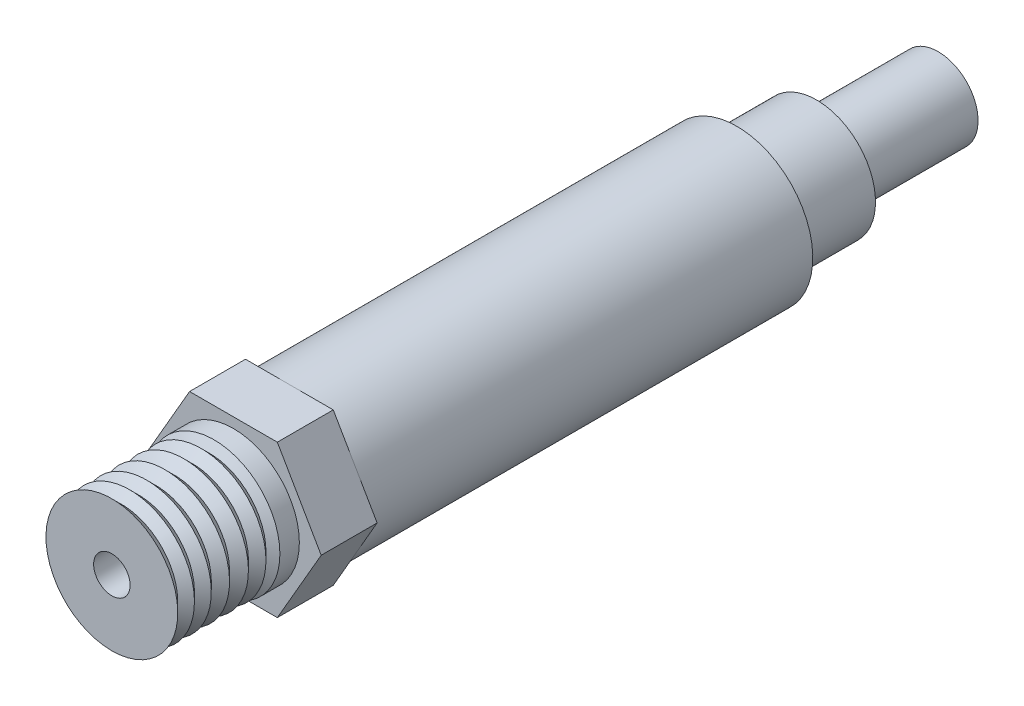
ISO-10303-21;
HEADER;
FILE_DESCRIPTION(('STEP AP214'),'2;1');
FILE_NAME('part.step','',(''),(''),'','','');
FILE_SCHEMA(('AUTOMOTIVE_DESIGN { 1 0 10303 214 1 1 1 1 }'));
ENDSEC;
DATA;
#1=APPLICATION_CONTEXT('core data for automotive mechanical design processes');
#2=APPLICATION_PROTOCOL_DEFINITION('international standard','automotive_design',2000,#1);
#3=PRODUCT_CONTEXT('',#1,'mechanical');
#4=PRODUCT('Part','Part','',(#3));
#5=PRODUCT_RELATED_PRODUCT_CATEGORY('part','',(#4));
#6=PRODUCT_DEFINITION_FORMATION('','',#4);
#7=PRODUCT_DEFINITION_CONTEXT('part definition',#1,'design');
#8=PRODUCT_DEFINITION('design','',#6,#7);
#9=PRODUCT_DEFINITION_SHAPE('','',#8);
#10=(LENGTH_UNIT() NAMED_UNIT(*) SI_UNIT(.MILLI.,.METRE.));
#11=(NAMED_UNIT(*) PLANE_ANGLE_UNIT() SI_UNIT($,.RADIAN.));
#12=(NAMED_UNIT(*) SI_UNIT($,.STERADIAN.) SOLID_ANGLE_UNIT());
#13=UNCERTAINTY_MEASURE_WITH_UNIT(LENGTH_MEASURE(1.E-05),#10,'distance_accuracy_value','');
#14=(GEOMETRIC_REPRESENTATION_CONTEXT(3) GLOBAL_UNCERTAINTY_ASSIGNED_CONTEXT((#13)) GLOBAL_UNIT_ASSIGNED_CONTEXT((#10,
#11,#12)) REPRESENTATION_CONTEXT('',''));
#15=CARTESIAN_POINT('',(0.,0.,0.));
#16=DIRECTION('',(0.,0.,1.));
#17=DIRECTION('',(1.,0.,0.));
#18=AXIS2_PLACEMENT_3D('',#15,#16,#17);
#19=CARTESIAN_POINT('',(0.,0.,-62.944375));
#20=DIRECTION('',(0.,0.,-1.));
#21=DIRECTION('',(-1.,0.,0.));
#22=AXIS2_PLACEMENT_3D('',#19,#20,#21);
#23=PLANE('',#22);
#24=CARTESIAN_POINT('',(0.,0.,-62.944375));
#25=DIRECTION('',(0.,0.,-1.));
#26=DIRECTION('',(-1.,0.,0.));
#27=AXIS2_PLACEMENT_3D('',#24,#25,#26);
#28=CIRCLE('',#27,6.1515625);
#29=CARTESIAN_POINT('',(-6.1515625,0.,-62.944375));
#30=VERTEX_POINT('',#29);
#31=EDGE_CURVE('E127',#30,#30,#28,.T.);
#32=ORIENTED_EDGE('',*,*,#31,.T.);
#33=EDGE_LOOP('',(#32));
#34=FACE_BOUND('',#33,.T.);
#35=CARTESIAN_POINT('',(0.,0.,-62.944375));
#36=DIRECTION('',(0.,0.,-1.));
#37=DIRECTION('',(-1.,0.,0.));
#38=AXIS2_PLACEMENT_3D('',#35,#36,#37);
#39=CIRCLE('',#38,4.1671875);
#40=CARTESIAN_POINT('',(-4.1671875,0.,-62.944375));
#41=VERTEX_POINT('',#40);
#42=EDGE_CURVE('E594',#41,#41,#39,.T.);
#43=ORIENTED_EDGE('',*,*,#42,.F.);
#44=EDGE_LOOP('',(#43));
#45=FACE_BOUND('',#44,.T.);
#46=ADVANCED_FACE('F32',(#34,#45),#23,.T.);
#47=CARTESIAN_POINT('',(0.,0.,-54.61));
#48=DIRECTION('',(0.,0.,-1.));
#49=DIRECTION('',(-1.,0.,0.));
#50=AXIS2_PLACEMENT_3D('',#47,#48,#49);
#51=PLANE('',#50);
#52=CARTESIAN_POINT('',(0.,0.,-54.61));
#53=DIRECTION('',(0.,0.,-1.));
#54=DIRECTION('',(-1.,0.,0.));
#55=AXIS2_PLACEMENT_3D('',#52,#53,#54);
#56=CIRCLE('',#55,7.9375);
#57=CARTESIAN_POINT('',(-7.9375,0.,-54.61));
#58=VERTEX_POINT('',#57);
#59=EDGE_CURVE('E126',#58,#58,#56,.T.);
#60=ORIENTED_EDGE('',*,*,#59,.T.);
#61=EDGE_LOOP('',(#60));
#62=FACE_BOUND('',#61,.T.);
#63=CARTESIAN_POINT('',(0.,0.,-54.61));
#64=DIRECTION('',(0.,0.,-1.));
#65=DIRECTION('',(-1.,0.,0.));
#66=AXIS2_PLACEMENT_3D('',#63,#64,#65);
#67=CIRCLE('',#66,6.1515625);
#68=CARTESIAN_POINT('',(-6.1515625,0.,-54.61));
#69=VERTEX_POINT('',#68);
#70=EDGE_CURVE('E593',#69,#69,#67,.T.);
#71=ORIENTED_EDGE('',*,*,#70,.F.);
#72=EDGE_LOOP('',(#71));
#73=FACE_BOUND('',#72,.T.);
#74=ADVANCED_FACE('F242',(#62,#73),#51,.T.);
#75=CARTESIAN_POINT('',(9.16543552338531,0.,-7.874));
#76=DIRECTION('',(0.,0.,-1.));
#77=DIRECTION('',(-1.,0.,0.));
#78=AXIS2_PLACEMENT_3D('',#75,#76,#77);
#79=PLANE('',#78);
#80=CARTESIAN_POINT('',(0.,0.,-7.874));
#81=DIRECTION('',(0.,0.,-1.));
#82=DIRECTION('',(-1.,0.,0.));
#83=AXIS2_PLACEMENT_3D('',#80,#81,#82);
#84=CIRCLE('',#83,7.9375);
#85=CARTESIAN_POINT('',(-6.87407664253898,3.96875,-7.874));
#86=VERTEX_POINT('',#85);
#87=CARTESIAN_POINT('',(0.,7.9375,-7.874));
#88=VERTEX_POINT('',#87);
#89=EDGE_CURVE('E43',#86,#88,#84,.T.);
#90=ORIENTED_EDGE('',*,*,#89,.F.);
#91=DIRECTION('',(0.5,0.866025403784439,0.));
#92=VECTOR('',#91,1.);
#93=CARTESIAN_POINT('',(-4.58271776169266,7.9375,-7.874));
#94=LINE('',#93,#92);
#95=CARTESIAN_POINT('',(-4.58271776169266,7.9375,-7.874));
#96=VERTEX_POINT('',#95);
#97=EDGE_CURVE('E111',#86,#96,#94,.T.);
#98=ORIENTED_EDGE('',*,*,#97,.T.);
#99=DIRECTION('',(1.,0.,0.));
#100=VECTOR('',#99,1.);
#101=CARTESIAN_POINT('',(4.58271776169265,7.9375,-7.874));
#102=LINE('',#101,#100);
#103=EDGE_CURVE('E124',#96,#88,#102,.T.);
#104=ORIENTED_EDGE('',*,*,#103,.T.);
#105=EDGE_LOOP('',(#90,#98,#104));
#106=FACE_BOUND('',#105,.T.);
#107=ADVANCED_FACE('F123',(#106),#79,.T.);
#108=CARTESIAN_POINT('',(6.87407664253898,3.96875,-7.874));
#109=VERTEX_POINT('',#108);
#110=EDGE_CURVE('E11',#88,#109,#84,.T.);
#111=ORIENTED_EDGE('',*,*,#110,.F.);
#112=CARTESIAN_POINT('',(4.58271776169265,7.9375,-7.874));
#113=VERTEX_POINT('',#112);
#114=EDGE_CURVE('E110',#88,#113,#102,.T.);
#115=ORIENTED_EDGE('',*,*,#114,.T.);
#116=DIRECTION('',(0.5,-0.866025403784438,0.));
#117=VECTOR('',#116,1.);
#118=CARTESIAN_POINT('',(9.16543552338531,0.,-7.874));
#119=LINE('',#118,#117);
#120=EDGE_CURVE('E154',#113,#109,#119,.T.);
#121=ORIENTED_EDGE('',*,*,#120,.T.);
#122=EDGE_LOOP('',(#111,#115,#121));
#123=FACE_BOUND('',#122,.T.);
#124=ADVANCED_FACE('F472',(#123),#79,.T.);
#125=CARTESIAN_POINT('',(6.87407664253898,-3.96875,-7.874));
#126=VERTEX_POINT('',#125);
#127=EDGE_CURVE('E41',#109,#126,#84,.T.);
#128=ORIENTED_EDGE('',*,*,#127,.F.);
#129=CARTESIAN_POINT('',(9.16543552338531,0.,-7.874));
#130=VERTEX_POINT('',#129);
#131=EDGE_CURVE('E153',#109,#130,#119,.T.);
#132=ORIENTED_EDGE('',*,*,#131,.T.);
#133=DIRECTION('',(-0.5,-0.866025403784439,0.));
#134=VECTOR('',#133,1.);
#135=CARTESIAN_POINT('',(4.58271776169265,-7.9375,-7.874));
#136=LINE('',#135,#134);
#137=EDGE_CURVE('E157',#130,#126,#136,.T.);
#138=ORIENTED_EDGE('',*,*,#137,.T.);
#139=EDGE_LOOP('',(#128,#132,#138));
#140=FACE_BOUND('',#139,.T.);
#141=ADVANCED_FACE('F479',(#140),#79,.T.);
#142=CARTESIAN_POINT('',(0.,-7.9375,-7.874));
#143=VERTEX_POINT('',#142);
#144=EDGE_CURVE('E132',#126,#143,#84,.T.);
#145=ORIENTED_EDGE('',*,*,#144,.F.);
#146=CARTESIAN_POINT('',(4.58271776169265,-7.9375,-7.874));
#147=VERTEX_POINT('',#146);
#148=EDGE_CURVE('E156',#126,#147,#136,.T.);
#149=ORIENTED_EDGE('',*,*,#148,.T.);
#150=DIRECTION('',(-1.,0.,0.));
#151=VECTOR('',#150,1.);
#152=CARTESIAN_POINT('',(4.58271776169265,-7.9375,-7.874));
#153=LINE('',#152,#151);
#154=EDGE_CURVE('E161',#147,#143,#153,.T.);
#155=ORIENTED_EDGE('',*,*,#154,.T.);
#156=EDGE_LOOP('',(#145,#149,#155));
#157=FACE_BOUND('',#156,.T.);
#158=ADVANCED_FACE('F486',(#157),#79,.T.);
#159=CARTESIAN_POINT('',(-6.87407664253898,-3.96875,-7.874));
#160=VERTEX_POINT('',#159);
#161=EDGE_CURVE('E131',#143,#160,#84,.T.);
#162=ORIENTED_EDGE('',*,*,#161,.F.);
#163=CARTESIAN_POINT('',(-4.58271776169265,-7.9375,-7.874));
#164=VERTEX_POINT('',#163);
#165=EDGE_CURVE('E160',#143,#164,#153,.T.);
#166=ORIENTED_EDGE('',*,*,#165,.T.);
#167=DIRECTION('',(-0.5,0.866025403784439,0.));
#168=VECTOR('',#167,1.);
#169=CARTESIAN_POINT('',(-9.16543552338531,0.,-7.874));
#170=LINE('',#169,#168);
#171=EDGE_CURVE('E121',#164,#160,#170,.T.);
#172=ORIENTED_EDGE('',*,*,#171,.T.);
#173=EDGE_LOOP('',(#162,#166,#172));
#174=FACE_BOUND('',#173,.T.);
#175=ADVANCED_FACE('F270',(#174),#79,.T.);
#176=CARTESIAN_POINT('',(0.,0.,10.668));
#177=DIRECTION('',(0.,0.,1.));
#178=DIRECTION('',(1.,0.,0.));
#179=AXIS2_PLACEMENT_3D('',#176,#177,#178);
#180=PLANE('',#179);
#181=CARTESIAN_POINT('',(0.,0.,10.668));
#182=DIRECTION('',(0.,0.,1.));
#183=DIRECTION('',(1.,0.,0.));
#184=AXIS2_PLACEMENT_3D('',#181,#182,#183);
#185=CIRCLE('',#184,1.905);
#186=CARTESIAN_POINT('',(1.905,0.,10.668));
#187=VERTEX_POINT('',#186);
#188=EDGE_CURVE('E185',#187,#187,#185,.T.);
#189=ORIENTED_EDGE('',*,*,#188,.F.);
#190=EDGE_LOOP('',(#189));
#191=FACE_BOUND('',#190,.T.);
#192=CARTESIAN_POINT('',(0.,0.,10.668));
#193=DIRECTION('',(0.,0.,1.));
#194=DIRECTION('',(0.,-1.,0.));
#195=AXIS2_PLACEMENT_3D('',#192,#193,#194);
#196=CIRCLE('',#195,6.88339999999998);
#197=CARTESIAN_POINT('',(0.,-6.88339999999998,10.668));
#198=VERTEX_POINT('',#197);
#199=EDGE_CURVE('E36',#198,#198,#196,.T.);
#200=ORIENTED_EDGE('',*,*,#199,.T.);
#201=EDGE_LOOP('',(#200));
#202=FACE_BOUND('',#201,.T.);
#203=ADVANCED_FACE('F34',(#191,#202),#180,.T.);
#204=CARTESIAN_POINT('',(0.,0.,10.668));
#205=DIRECTION('',(0.,0.,1.));
#206=DIRECTION('',(0.,-1.,0.));
#207=AXIS2_PLACEMENT_3D('',#204,#205,#206);
#208=CONICAL_SURFACE('',#207,6.88339999999998,0.785398163397433);
#209=CARTESIAN_POINT('',(0.,0.,9.67293695090437));
#210=DIRECTION('',(0.,0.,1.));
#211=DIRECTION('',(0.,-1.,0.));
#212=AXIS2_PLACEMENT_3D('',#209,#210,#211);
#213=CIRCLE('',#212,5.88833695090438);
#214=CARTESIAN_POINT('',(0.,-5.88833695090438,9.67293695090437));
#215=VERTEX_POINT('',#214);
#216=EDGE_CURVE('E134',#215,#215,#213,.T.);
#217=ORIENTED_EDGE('',*,*,#216,.T.);
#218=EDGE_LOOP('',(#217));
#219=FACE_BOUND('',#218,.T.);
#220=ORIENTED_EDGE('',*,*,#199,.F.);
#221=EDGE_LOOP('',(#220));
#222=FACE_BOUND('',#221,.T.);
#223=ADVANCED_FACE('F226',(#219,#222),#208,.T.);
#224=CARTESIAN_POINT('',(0.,0.,9.67293695090437));
#225=DIRECTION('',(0.,0.,-1.));
#226=DIRECTION('',(0.,1.,0.));
#227=AXIS2_PLACEMENT_3D('',#224,#225,#226);
#228=CONICAL_SURFACE('',#227,5.88833695090438,0.785398163397464);
#229=CARTESIAN_POINT('',(0.,0.,8.80237984496124));
#230=DIRECTION('',(0.,0.,1.));
#231=DIRECTION('',(0.,-1.,0.));
#232=AXIS2_PLACEMENT_3D('',#229,#230,#231);
#233=CIRCLE('',#232,6.75889405684754);
#234=CARTESIAN_POINT('',(0.,-6.75889405684754,8.80237984496124));
#235=VERTEX_POINT('',#234);
#236=EDGE_CURVE('E221',#235,#235,#233,.T.);
#237=ORIENTED_EDGE('',*,*,#236,.T.);
#238=EDGE_LOOP('',(#237));
#239=FACE_BOUND('',#238,.T.);
#240=ORIENTED_EDGE('',*,*,#216,.F.);
#241=EDGE_LOOP('',(#240));
#242=FACE_BOUND('',#241,.T.);
#243=ADVANCED_FACE('F229',(#239,#242),#228,.T.);
#244=CARTESIAN_POINT('',(0.,0.,8.80237984496124));
#245=DIRECTION('',(0.,0.,1.));
#246=DIRECTION('',(0.,-1.,0.));
#247=AXIS2_PLACEMENT_3D('',#244,#245,#246);
#248=CONICAL_SURFACE('',#247,6.75889405684754,0.785398163397432);
#249=CARTESIAN_POINT('',(0.,0.,7.92194496124028));
#250=DIRECTION('',(0.,0.,1.));
#251=DIRECTION('',(0.,-1.,0.));
#252=AXIS2_PLACEMENT_3D('',#249,#250,#251);
#253=CIRCLE('',#252,5.87845917312661);
#254=CARTESIAN_POINT('',(0.,-5.87845917312661,7.92194496124028));
#255=VERTEX_POINT('',#254);
#256=EDGE_CURVE('E218',#255,#255,#253,.T.);
#257=ORIENTED_EDGE('',*,*,#256,.T.);
#258=EDGE_LOOP('',(#257));
#259=FACE_BOUND('',#258,.T.);
#260=ORIENTED_EDGE('',*,*,#236,.F.);
#261=EDGE_LOOP('',(#260));
#262=FACE_BOUND('',#261,.T.);
#263=ADVANCED_FACE('F231',(#259,#262),#248,.T.);
#264=CARTESIAN_POINT('',(0.,0.,7.92194496124028));
#265=DIRECTION('',(0.,0.,-1.));
#266=DIRECTION('',(0.,1.,0.));
#267=AXIS2_PLACEMENT_3D('',#264,#265,#266);
#268=CONICAL_SURFACE('',#267,5.87845917312661,0.785398163397464);
#269=CARTESIAN_POINT('',(0.,0.,7.04151007751938));
#270=DIRECTION('',(0.,0.,1.));
#271=DIRECTION('',(0.,-1.,0.));
#272=AXIS2_PLACEMENT_3D('',#269,#270,#271);
#273=CIRCLE('',#272,6.75889405684754);
#274=CARTESIAN_POINT('',(0.,-6.75889405684754,7.04151007751938));
#275=VERTEX_POINT('',#274);
#276=EDGE_CURVE('E215',#275,#275,#273,.T.);
#277=ORIENTED_EDGE('',*,*,#276,.T.);
#278=EDGE_LOOP('',(#277));
#279=FACE_BOUND('',#278,.T.);
#280=ORIENTED_EDGE('',*,*,#256,.F.);
#281=EDGE_LOOP('',(#280));
#282=FACE_BOUND('',#281,.T.);
#283=ADVANCED_FACE('F238',(#279,#282),#268,.T.);
#284=CARTESIAN_POINT('',(0.,0.,7.04151007751938));
#285=DIRECTION('',(0.,0.,1.));
#286=DIRECTION('',(0.,-1.,0.));
#287=AXIS2_PLACEMENT_3D('',#284,#285,#286);
#288=CONICAL_SURFACE('',#287,6.75889405684754,0.785398163397433);
#289=CARTESIAN_POINT('',(0.,0.,6.08992894056845));
#290=DIRECTION('',(0.,0.,1.));
#291=DIRECTION('',(0.,-1.,0.));
#292=AXIS2_PLACEMENT_3D('',#289,#290,#291);
#293=CIRCLE('',#292,5.80731291989664);
#294=CARTESIAN_POINT('',(0.,-5.80731291989664,6.08992894056845));
#295=VERTEX_POINT('',#294);
#296=EDGE_CURVE('E212',#295,#295,#293,.T.);
#297=ORIENTED_EDGE('',*,*,#296,.T.);
#298=EDGE_LOOP('',(#297));
#299=FACE_BOUND('',#298,.T.);
#300=ORIENTED_EDGE('',*,*,#276,.F.);
#301=EDGE_LOOP('',(#300));
#302=FACE_BOUND('',#301,.T.);
#303=ADVANCED_FACE('F331',(#299,#302),#288,.T.);
#304=CARTESIAN_POINT('',(0.,0.,6.08992894056845));
#305=DIRECTION('',(0.,0.,-1.));
#306=DIRECTION('',(0.,1.,0.));
#307=AXIS2_PLACEMENT_3D('',#304,#305,#306);
#308=CONICAL_SURFACE('',#307,5.80731291989664,0.785398163397464);
#309=CARTESIAN_POINT('',(0.,0.,5.13834780361757));
#310=DIRECTION('',(0.,0.,1.));
#311=DIRECTION('',(0.,-1.,0.));
#312=AXIS2_PLACEMENT_3D('',#309,#310,#311);
#313=CIRCLE('',#312,6.75889405684754);
#314=CARTESIAN_POINT('',(0.,-6.75889405684754,5.13834780361757));
#315=VERTEX_POINT('',#314);
#316=EDGE_CURVE('E209',#315,#315,#313,.T.);
#317=ORIENTED_EDGE('',*,*,#316,.T.);
#318=EDGE_LOOP('',(#317));
#319=FACE_BOUND('',#318,.T.);
#320=ORIENTED_EDGE('',*,*,#296,.F.);
#321=EDGE_LOOP('',(#320));
#322=FACE_BOUND('',#321,.T.);
#323=ADVANCED_FACE('F327',(#319,#322),#308,.T.);
#324=CARTESIAN_POINT('',(0.,0.,5.13834780361757));
#325=DIRECTION('',(0.,0.,1.));
#326=DIRECTION('',(0.,-1.,0.));
#327=AXIS2_PLACEMENT_3D('',#324,#325,#326);
#328=CONICAL_SURFACE('',#327,6.75889405684754,0.785398163397432);
#329=CARTESIAN_POINT('',(0.,0.,4.15119354005165));
#330=DIRECTION('',(0.,0.,1.));
#331=DIRECTION('',(0.,-1.,0.));
#332=AXIS2_PLACEMENT_3D('',#329,#330,#331);
#333=CIRCLE('',#332,5.77173979328165);
#334=CARTESIAN_POINT('',(0.,-5.77173979328165,4.15119354005165));
#335=VERTEX_POINT('',#334);
#336=EDGE_CURVE('E206',#335,#335,#333,.T.);
#337=ORIENTED_EDGE('',*,*,#336,.T.);
#338=EDGE_LOOP('',(#337));
#339=FACE_BOUND('',#338,.T.);
#340=ORIENTED_EDGE('',*,*,#316,.F.);
#341=EDGE_LOOP('',(#340));
#342=FACE_BOUND('',#341,.T.);
#343=ADVANCED_FACE('F323',(#339,#342),#328,.T.);
#344=CARTESIAN_POINT('',(0.,0.,4.15119354005165));
#345=DIRECTION('',(0.,0.,-1.));
#346=DIRECTION('',(0.,1.,0.));
#347=AXIS2_PLACEMENT_3D('',#344,#345,#346);
#348=CONICAL_SURFACE('',#347,5.77173979328165,0.785398163397465);
#349=CARTESIAN_POINT('',(0.,0.,3.16403927648579));
#350=DIRECTION('',(0.,0.,1.));
#351=DIRECTION('',(0.,-1.,0.));
#352=AXIS2_PLACEMENT_3D('',#349,#350,#351);
#353=CIRCLE('',#352,6.75889405684754);
#354=CARTESIAN_POINT('',(0.,-6.75889405684754,3.16403927648579));
#355=VERTEX_POINT('',#354);
#356=EDGE_CURVE('E203',#355,#355,#353,.T.);
#357=ORIENTED_EDGE('',*,*,#356,.T.);
#358=EDGE_LOOP('',(#357));
#359=FACE_BOUND('',#358,.T.);
#360=ORIENTED_EDGE('',*,*,#336,.F.);
#361=EDGE_LOOP('',(#360));
#362=FACE_BOUND('',#361,.T.);
#363=ADVANCED_FACE('F319',(#359,#362),#348,.T.);
#364=CARTESIAN_POINT('',(0.,0.,3.16403927648579));
#365=DIRECTION('',(0.,0.,1.));
#366=DIRECTION('',(0.,-1.,0.));
#367=AXIS2_PLACEMENT_3D('',#364,#365,#366);
#368=CONICAL_SURFACE('',#367,6.75889405684754,0.785398163397447);
#369=CARTESIAN_POINT('',(0.,0.,2.24803126614987));
#370=DIRECTION('',(0.,0.,1.));
#371=DIRECTION('',(0.,-1.,0.));
#372=AXIS2_PLACEMENT_3D('',#369,#370,#371);
#373=CIRCLE('',#372,5.84288604651162);
#374=CARTESIAN_POINT('',(0.,-5.84288604651162,2.24803126614987));
#375=VERTEX_POINT('',#374);
#376=EDGE_CURVE('E200',#375,#375,#373,.T.);
#377=ORIENTED_EDGE('',*,*,#376,.T.);
#378=EDGE_LOOP('',(#377));
#379=FACE_BOUND('',#378,.T.);
#380=ORIENTED_EDGE('',*,*,#356,.F.);
#381=EDGE_LOOP('',(#380));
#382=FACE_BOUND('',#381,.T.);
#383=ADVANCED_FACE('F315',(#379,#382),#368,.T.);
#384=CARTESIAN_POINT('',(0.,0.,2.24803126614987));
#385=DIRECTION('',(0.,0.,-1.));
#386=DIRECTION('',(0.,1.,0.));
#387=AXIS2_PLACEMENT_3D('',#384,#385,#386);
#388=CONICAL_SURFACE('',#387,5.84288604651162,0.78539816339745);
#389=CARTESIAN_POINT('',(0.,0.,1.33202325581396));
#390=DIRECTION('',(0.,0.,1.));
#391=DIRECTION('',(0.,-1.,0.));
#392=AXIS2_PLACEMENT_3D('',#389,#390,#391);
#393=CIRCLE('',#392,6.75889405684754);
#394=CARTESIAN_POINT('',(0.,-6.75889405684754,1.33202325581396));
#395=VERTEX_POINT('',#394);
#396=EDGE_CURVE('E197',#395,#395,#393,.T.);
#397=ORIENTED_EDGE('',*,*,#396,.T.);
#398=EDGE_LOOP('',(#397));
#399=FACE_BOUND('',#398,.T.);
#400=ORIENTED_EDGE('',*,*,#376,.F.);
#401=EDGE_LOOP('',(#400));
#402=FACE_BOUND('',#401,.T.);
#403=ADVANCED_FACE('F311',(#399,#402),#388,.T.);
#404=CARTESIAN_POINT('',(0.,0.,1.33202325581396));
#405=DIRECTION('',(0.,0.,1.));
#406=DIRECTION('',(0.,-1.,0.));
#407=AXIS2_PLACEMENT_3D('',#404,#405,#406);
#408=CONICAL_SURFACE('',#407,6.75889405684754,0.785398163397447);
#409=CARTESIAN_POINT('',(0.,0.,0.514702761949875));
#410=DIRECTION('',(0.,0.,1.));
#411=DIRECTION('',(0.,-1.,0.));
#412=AXIS2_PLACEMENT_3D('',#409,#410,#411);
#413=CIRCLE('',#412,5.94157356298346);
#414=CARTESIAN_POINT('',(0.,-5.94157356298346,0.514702761949876));
#415=VERTEX_POINT('',#414);
#416=EDGE_CURVE('E194',#415,#415,#413,.T.);
#417=ORIENTED_EDGE('',*,*,#416,.T.);
#418=EDGE_LOOP('',(#417));
#419=FACE_BOUND('',#418,.T.);
#420=ORIENTED_EDGE('',*,*,#396,.F.);
#421=EDGE_LOOP('',(#420));
#422=FACE_BOUND('',#421,.T.);
#423=ADVANCED_FACE('F307',(#419,#422),#408,.T.);
#424=CARTESIAN_POINT('',(0.,0.,0.514702761949875));
#425=DIRECTION('',(0.,0.,-1.));
#426=DIRECTION('',(0.,1.,0.));
#427=AXIS2_PLACEMENT_3D('',#424,#425,#426);
#428=CONICAL_SURFACE('',#427,5.94157356298346,1.07064863018592);
#429=CARTESIAN_POINT('',(0.,0.,0.));
#430=DIRECTION('',(0.,0.,1.));
#431=DIRECTION('',(1.,0.,0.));
#432=AXIS2_PLACEMENT_3D('',#429,#430,#431);
#433=CIRCLE('',#432,6.88339999999998);
#434=CARTESIAN_POINT('',(6.88339999999998,0.,0.));
#435=VERTEX_POINT('',#434);
#436=EDGE_CURVE('E191',#435,#435,#433,.T.);
#437=ORIENTED_EDGE('',*,*,#436,.T.);
#438=EDGE_LOOP('',(#437));
#439=FACE_BOUND('',#438,.T.);
#440=ORIENTED_EDGE('',*,*,#416,.F.);
#441=EDGE_LOOP('',(#440));
#442=FACE_BOUND('',#441,.T.);
#443=ADVANCED_FACE('F303',(#439,#442),#428,.T.);
#444=CARTESIAN_POINT('',(0.,0.,-2.032));
#445=DIRECTION('',(0.,0.,1.));
#446=DIRECTION('',(1.,0.,0.));
#447=AXIS2_PLACEMENT_3D('',#444,#445,#446);
#448=CYLINDRICAL_SURFACE('',#447,6.88339999999998);
#449=CARTESIAN_POINT('',(0.,0.,-2.032));
#450=DIRECTION('',(0.,0.,-1.));
#451=DIRECTION('',(-1.,0.,0.));
#452=AXIS2_PLACEMENT_3D('',#449,#450,#451);
#453=CIRCLE('',#452,6.88339999999998);
#454=CARTESIAN_POINT('',(-6.88339999999998,0.,-2.032));
#455=VERTEX_POINT('',#454);
#456=EDGE_CURVE('E182',#455,#455,#453,.F.);
#457=ORIENTED_EDGE('',*,*,#456,.T.);
#458=EDGE_LOOP('',(#457));
#459=FACE_BOUND('',#458,.T.);
#460=ORIENTED_EDGE('',*,*,#436,.F.);
#461=EDGE_LOOP('',(#460));
#462=FACE_BOUND('',#461,.T.);
#463=ADVANCED_FACE('F299',(#459,#462),#448,.T.);
#464=CARTESIAN_POINT('',(0.,0.,4.318));
#465=DIRECTION('',(0.,0.,1.));
#466=DIRECTION('',(1.,0.,0.));
#467=AXIS2_PLACEMENT_3D('',#464,#465,#466);
#468=CYLINDRICAL_SURFACE('',#467,1.905);
#469=CARTESIAN_POINT('',(0.,0.,4.318));
#470=DIRECTION('',(0.,0.,1.));
#471=DIRECTION('',(1.,0.,0.));
#472=AXIS2_PLACEMENT_3D('',#469,#470,#471);
#473=CIRCLE('',#472,1.905);
#474=CARTESIAN_POINT('',(1.905,0.,4.318));
#475=VERTEX_POINT('',#474);
#476=EDGE_CURVE('E188',#475,#475,#473,.T.);
#477=ORIENTED_EDGE('',*,*,#476,.F.);
#478=EDGE_LOOP('',(#477));
#479=FACE_BOUND('',#478,.T.);
#480=ORIENTED_EDGE('',*,*,#188,.T.);
#481=EDGE_LOOP('',(#480));
#482=FACE_BOUND('',#481,.T.);
#483=ADVANCED_FACE('F295',(#479,#482),#468,.F.);
#484=CARTESIAN_POINT('',(0.,0.,4.318));
#485=DIRECTION('',(0.,0.,1.));
#486=DIRECTION('',(1.,0.,0.));
#487=AXIS2_PLACEMENT_3D('',#484,#485,#486);
#488=PLANE('',#487);
#489=ORIENTED_EDGE('',*,*,#476,.T.);
#490=EDGE_LOOP('',(#489));
#491=FACE_BOUND('',#490,.T.);
#492=ADVANCED_FACE('F291',(#491),#488,.T.);
#493=CARTESIAN_POINT('',(9.16543552338531,0.,-7.874));
#494=DIRECTION('',(-0.866025403784439,-0.5,0.));
#495=DIRECTION('',(0.5,-0.866025403784438,0.));
#496=AXIS2_PLACEMENT_3D('',#493,#494,#495);
#497=PLANE('',#496);
#498=DIRECTION('',(0.5,-0.866025403784438,0.));
#499=VECTOR('',#498,1.);
#500=CARTESIAN_POINT('',(9.16543552338531,0.,-2.032));
#501=LINE('',#500,#499);
#502=CARTESIAN_POINT('',(4.58271776169265,7.9375,-2.032));
#503=VERTEX_POINT('',#502);
#504=CARTESIAN_POINT('',(9.16543552338531,0.,-2.032));
#505=VERTEX_POINT('',#504);
#506=EDGE_CURVE('E140',#503,#505,#501,.T.);
#507=ORIENTED_EDGE('',*,*,#506,.T.);
#508=DIRECTION('',(0.,0.,1.));
#509=VECTOR('',#508,1.);
#510=CARTESIAN_POINT('',(9.16543552338531,0.,-7.874));
#511=LINE('',#510,#509);
#512=EDGE_CURVE('E179',#130,#505,#511,.T.);
#513=ORIENTED_EDGE('',*,*,#512,.F.);
#514=ORIENTED_EDGE('',*,*,#131,.F.);
#515=ORIENTED_EDGE('',*,*,#120,.F.);
#516=DIRECTION('',(0.,0.,1.));
#517=VECTOR('',#516,1.);
#518=CARTESIAN_POINT('',(4.58271776169265,7.9375,-7.874));
#519=LINE('',#518,#517);
#520=EDGE_CURVE('E167',#113,#503,#519,.T.);
#521=ORIENTED_EDGE('',*,*,#520,.T.);
#522=EDGE_LOOP('',(#507,#513,#514,#515,#521));
#523=FACE_BOUND('',#522,.T.);
#524=ADVANCED_FACE('F287',(#523),#497,.F.);
#525=CARTESIAN_POINT('',(4.58271776169265,-7.9375,-7.874));
#526=DIRECTION('',(-0.866025403784439,0.5,0.));
#527=DIRECTION('',(-0.5,-0.866025403784439,0.));
#528=AXIS2_PLACEMENT_3D('',#525,#526,#527);
#529=PLANE('',#528);
#530=DIRECTION('',(-0.5,-0.866025403784439,0.));
#531=VECTOR('',#530,1.);
#532=CARTESIAN_POINT('',(4.58271776169265,-7.9375,-2.032));
#533=LINE('',#532,#531);
#534=CARTESIAN_POINT('',(4.58271776169265,-7.9375,-2.032));
#535=VERTEX_POINT('',#534);
#536=EDGE_CURVE('E143',#505,#535,#533,.T.);
#537=ORIENTED_EDGE('',*,*,#536,.T.);
#538=DIRECTION('',(0.,0.,1.));
#539=VECTOR('',#538,1.);
#540=CARTESIAN_POINT('',(4.58271776169265,-7.9375,-7.874));
#541=LINE('',#540,#539);
#542=EDGE_CURVE('E176',#147,#535,#541,.T.);
#543=ORIENTED_EDGE('',*,*,#542,.F.);
#544=ORIENTED_EDGE('',*,*,#148,.F.);
#545=ORIENTED_EDGE('',*,*,#137,.F.);
#546=ORIENTED_EDGE('',*,*,#512,.T.);
#547=EDGE_LOOP('',(#537,#543,#544,#545,#546));
#548=FACE_BOUND('',#547,.T.);
#549=ADVANCED_FACE('F283',(#548),#529,.F.);
#550=CARTESIAN_POINT('',(4.58271776169265,-7.9375,-7.874));
#551=DIRECTION('',(0.,1.,0.));
#552=DIRECTION('',(0.,0.,1.));
#553=AXIS2_PLACEMENT_3D('',#550,#551,#552);
#554=PLANE('',#553);
#555=DIRECTION('',(-1.,0.,0.));
#556=VECTOR('',#555,1.);
#557=CARTESIAN_POINT('',(4.58271776169265,-7.9375,-2.032));
#558=LINE('',#557,#556);
#559=CARTESIAN_POINT('',(-4.58271776169265,-7.9375,-2.032));
#560=VERTEX_POINT('',#559);
#561=EDGE_CURVE('E145',#535,#560,#558,.T.);
#562=ORIENTED_EDGE('',*,*,#561,.T.);
#563=DIRECTION('',(0.,0.,1.));
#564=VECTOR('',#563,1.);
#565=CARTESIAN_POINT('',(-4.58271776169265,-7.9375,-7.874));
#566=LINE('',#565,#564);
#567=EDGE_CURVE('E173',#164,#560,#566,.T.);
#568=ORIENTED_EDGE('',*,*,#567,.F.);
#569=ORIENTED_EDGE('',*,*,#165,.F.);
#570=ORIENTED_EDGE('',*,*,#154,.F.);
#571=ORIENTED_EDGE('',*,*,#542,.T.);
#572=EDGE_LOOP('',(#562,#568,#569,#570,#571));
#573=FACE_BOUND('',#572,.T.);
#574=ADVANCED_FACE('F279',(#573),#554,.F.);
#575=CARTESIAN_POINT('',(-9.16543552338531,0.,-7.874));
#576=DIRECTION('',(0.866025403784439,0.5,0.));
#577=DIRECTION('',(-0.5,0.866025403784439,0.));
#578=AXIS2_PLACEMENT_3D('',#575,#576,#577);
#579=PLANE('',#578);
#580=DIRECTION('',(-0.5,0.866025403784439,0.));
#581=VECTOR('',#580,1.);
#582=CARTESIAN_POINT('',(-9.16543552338531,0.,-2.032));
#583=LINE('',#582,#581);
#584=CARTESIAN_POINT('',(-9.16543552338531,0.,-2.032));
#585=VERTEX_POINT('',#584);
#586=EDGE_CURVE('E147',#560,#585,#583,.T.);
#587=ORIENTED_EDGE('',*,*,#586,.T.);
#588=DIRECTION('',(0.,0.,1.));
#589=VECTOR('',#588,1.);
#590=CARTESIAN_POINT('',(-9.16543552338531,0.,-7.874));
#591=LINE('',#590,#589);
#592=CARTESIAN_POINT('',(-9.16543552338531,0.,-7.874));
#593=VERTEX_POINT('',#592);
#594=EDGE_CURVE('E171',#593,#585,#591,.T.);
#595=ORIENTED_EDGE('',*,*,#594,.F.);
#596=EDGE_CURVE('E106',#160,#593,#170,.T.);
#597=ORIENTED_EDGE('',*,*,#596,.F.);
#598=ORIENTED_EDGE('',*,*,#171,.F.);
#599=ORIENTED_EDGE('',*,*,#567,.T.);
#600=EDGE_LOOP('',(#587,#595,#597,#598,#599));
#601=FACE_BOUND('',#600,.T.);
#602=ADVANCED_FACE('F276',(#601),#579,.F.);
#603=CARTESIAN_POINT('',(-4.58271776169266,7.9375,-7.874));
#604=DIRECTION('',(0.866025403784439,-0.5,0.));
#605=DIRECTION('',(0.5,0.866025403784439,0.));
#606=AXIS2_PLACEMENT_3D('',#603,#604,#605);
#607=PLANE('',#606);
#608=DIRECTION('',(0.5,0.866025403784439,0.));
#609=VECTOR('',#608,1.);
#610=CARTESIAN_POINT('',(-4.58271776169266,7.9375,-2.032));
#611=LINE('',#610,#609);
#612=CARTESIAN_POINT('',(-4.58271776169266,7.9375,-2.032));
#613=VERTEX_POINT('',#612);
#614=EDGE_CURVE('E149',#585,#613,#611,.T.);
#615=ORIENTED_EDGE('',*,*,#614,.T.);
#616=DIRECTION('',(0.,0.,1.));
#617=VECTOR('',#616,1.);
#618=CARTESIAN_POINT('',(-4.58271776169266,7.9375,-7.874));
#619=LINE('',#618,#617);
#620=EDGE_CURVE('E117',#96,#613,#619,.T.);
#621=ORIENTED_EDGE('',*,*,#620,.F.);
#622=ORIENTED_EDGE('',*,*,#97,.F.);
#623=EDGE_CURVE('E103',#593,#86,#94,.T.);
#624=ORIENTED_EDGE('',*,*,#623,.F.);
#625=ORIENTED_EDGE('',*,*,#594,.T.);
#626=EDGE_LOOP('',(#615,#621,#622,#624,#625));
#627=FACE_BOUND('',#626,.T.);
#628=ADVANCED_FACE('F115',(#627),#607,.F.);
#629=CARTESIAN_POINT('',(4.58271776169265,7.9375,-7.874));
#630=DIRECTION('',(0.,-1.,0.));
#631=DIRECTION('',(0.,0.,-1.));
#632=AXIS2_PLACEMENT_3D('',#629,#630,#631);
#633=PLANE('',#632);
#634=DIRECTION('',(1.,0.,0.));
#635=VECTOR('',#634,1.);
#636=CARTESIAN_POINT('',(4.58271776169265,7.9375,-2.032));
#637=LINE('',#636,#635);
#638=EDGE_CURVE('E151',#613,#503,#637,.T.);
#639=ORIENTED_EDGE('',*,*,#638,.T.);
#640=ORIENTED_EDGE('',*,*,#520,.F.);
#641=ORIENTED_EDGE('',*,*,#114,.F.);
#642=ORIENTED_EDGE('',*,*,#103,.F.);
#643=ORIENTED_EDGE('',*,*,#620,.T.);
#644=EDGE_LOOP('',(#639,#640,#641,#642,#643));
#645=FACE_BOUND('',#644,.T.);
#646=ADVANCED_FACE('F269',(#645),#633,.F.);
#647=EDGE_CURVE('E56',#160,#86,#84,.T.);
#648=ORIENTED_EDGE('',*,*,#647,.F.);
#649=ORIENTED_EDGE('',*,*,#596,.T.);
#650=ORIENTED_EDGE('',*,*,#623,.T.);
#651=EDGE_LOOP('',(#648,#649,#650));
#652=FACE_BOUND('',#651,.T.);
#653=ADVANCED_FACE('F105',(#652),#79,.T.);
#654=CARTESIAN_POINT('',(9.16543552338531,0.,-2.032));
#655=DIRECTION('',(0.,0.,-1.));
#656=DIRECTION('',(-1.,0.,0.));
#657=AXIS2_PLACEMENT_3D('',#654,#655,#656);
#658=PLANE('',#657);
#659=ORIENTED_EDGE('',*,*,#456,.F.);
#660=EDGE_LOOP('',(#659));
#661=FACE_BOUND('',#660,.T.);
#662=ORIENTED_EDGE('',*,*,#506,.F.);
#663=ORIENTED_EDGE('',*,*,#638,.F.);
#664=ORIENTED_EDGE('',*,*,#614,.F.);
#665=ORIENTED_EDGE('',*,*,#586,.F.);
#666=ORIENTED_EDGE('',*,*,#561,.F.);
#667=ORIENTED_EDGE('',*,*,#536,.F.);
#668=EDGE_LOOP('',(#662,#663,#664,#665,#666,#667));
#669=FACE_BOUND('',#668,.T.);
#670=ADVANCED_FACE('F262',(#661,#669),#658,.F.);
#671=CARTESIAN_POINT('',(0.,0.,-54.61));
#672=DIRECTION('',(0.,0.,1.));
#673=DIRECTION('',(1.,0.,0.));
#674=AXIS2_PLACEMENT_3D('',#671,#672,#673);
#675=CYLINDRICAL_SURFACE('',#674,7.9375);
#676=ORIENTED_EDGE('',*,*,#59,.F.);
#677=EDGE_LOOP('',(#676));
#678=FACE_BOUND('',#677,.T.);
#679=ORIENTED_EDGE('',*,*,#89,.T.);
#680=ORIENTED_EDGE('',*,*,#110,.T.);
#681=ORIENTED_EDGE('',*,*,#127,.T.);
#682=ORIENTED_EDGE('',*,*,#144,.T.);
#683=ORIENTED_EDGE('',*,*,#161,.T.);
#684=ORIENTED_EDGE('',*,*,#647,.T.);
#685=EDGE_LOOP('',(#679,#680,#681,#682,#683,#684));
#686=FACE_BOUND('',#685,.T.);
#687=ADVANCED_FACE('F129',(#678,#686),#675,.T.);
#688=CARTESIAN_POINT('',(0.,0.,-62.944375));
#689=DIRECTION('',(0.,0.,1.));
#690=DIRECTION('',(1.,0.,0.));
#691=AXIS2_PLACEMENT_3D('',#688,#689,#690);
#692=CYLINDRICAL_SURFACE('',#691,6.1515625);
#693=ORIENTED_EDGE('',*,*,#31,.F.);
#694=EDGE_LOOP('',(#693));
#695=FACE_BOUND('',#694,.T.);
#696=ORIENTED_EDGE('',*,*,#70,.T.);
#697=EDGE_LOOP('',(#696));
#698=FACE_BOUND('',#697,.T.);
#699=ADVANCED_FACE('F256',(#695,#698),#692,.T.);
#700=CARTESIAN_POINT('',(0.,0.,-75.644375));
#701=DIRECTION('',(0.,0.,1.));
#702=DIRECTION('',(1.,0.,0.));
#703=AXIS2_PLACEMENT_3D('',#700,#701,#702);
#704=CYLINDRICAL_SURFACE('',#703,4.1671875);
#705=CARTESIAN_POINT('',(0.,0.,-75.644375));
#706=DIRECTION('',(0.,0.,-1.));
#707=DIRECTION('',(-1.,0.,0.));
#708=AXIS2_PLACEMENT_3D('',#705,#706,#707);
#709=CIRCLE('',#708,4.1671875);
#710=CARTESIAN_POINT('',(-4.1671875,0.,-75.644375));
#711=VERTEX_POINT('',#710);
#712=EDGE_CURVE('E592',#711,#711,#709,.T.);
#713=ORIENTED_EDGE('',*,*,#712,.F.);
#714=EDGE_LOOP('',(#713));
#715=FACE_BOUND('',#714,.T.);
#716=ORIENTED_EDGE('',*,*,#42,.T.);
#717=EDGE_LOOP('',(#716));
#718=FACE_BOUND('',#717,.T.);
#719=ADVANCED_FACE('F254',(#715,#718),#704,.T.);
#720=CARTESIAN_POINT('',(0.,0.,-75.644375));
#721=DIRECTION('',(0.,0.,-1.));
#722=DIRECTION('',(-1.,0.,0.));
#723=AXIS2_PLACEMENT_3D('',#720,#721,#722);
#724=PLANE('',#723);
#725=ORIENTED_EDGE('',*,*,#712,.T.);
#726=EDGE_LOOP('',(#725));
#727=FACE_BOUND('',#726,.T.);
#728=ADVANCED_FACE('F442',(#727),#724,.T.);
#729=CLOSED_SHELL('',(#46,#74,#107,#124,#141,#158,#175,#203,#223,#243,#263,#283,#303,#323,#343,
#363,#383,#403,#423,#443,#463,#483,#492,#524,#549,#574,#602,#628,#646,#653,#670,#687,#699,#719,#728));
#730=MANIFOLD_SOLID_BREP('B2',#729);
#731=ADVANCED_BREP_SHAPE_REPRESENTATION('',(#18,#730),#14);
#732=SHAPE_DEFINITION_REPRESENTATION(#9,#731);
ENDSEC;
END-ISO-10303-21;
